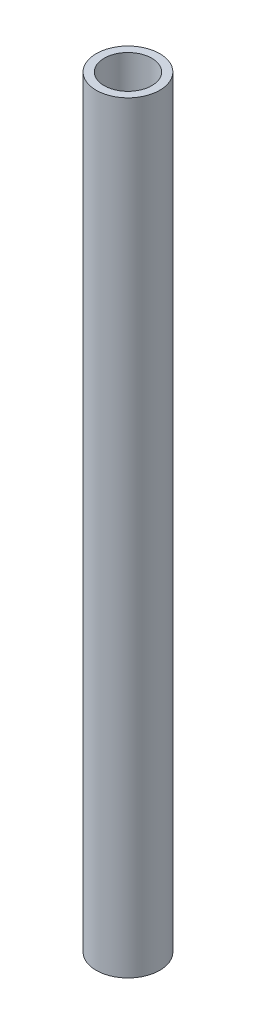
ISO-10303-21;
HEADER;
FILE_DESCRIPTION(('STEP AP214'),'2;1');
FILE_NAME('part.step','',(''),(''),'','','');
FILE_SCHEMA(('AUTOMOTIVE_DESIGN { 1 0 10303 214 1 1 1 1 }'));
ENDSEC;
DATA;
#1=APPLICATION_CONTEXT('core data for automotive mechanical design processes');
#2=APPLICATION_PROTOCOL_DEFINITION('international standard','automotive_design',2000,#1);
#3=PRODUCT_CONTEXT('',#1,'mechanical');
#4=PRODUCT('Part','Part','',(#3));
#5=PRODUCT_RELATED_PRODUCT_CATEGORY('part','',(#4));
#6=PRODUCT_DEFINITION_FORMATION('','',#4);
#7=PRODUCT_DEFINITION_CONTEXT('part definition',#1,'design');
#8=PRODUCT_DEFINITION('design','',#6,#7);
#9=PRODUCT_DEFINITION_SHAPE('','',#8);
#10=(LENGTH_UNIT() NAMED_UNIT(*) SI_UNIT(.MILLI.,.METRE.));
#11=(NAMED_UNIT(*) PLANE_ANGLE_UNIT() SI_UNIT($,.RADIAN.));
#12=(NAMED_UNIT(*) SI_UNIT($,.STERADIAN.) SOLID_ANGLE_UNIT());
#13=UNCERTAINTY_MEASURE_WITH_UNIT(LENGTH_MEASURE(1.E-05),#10,'distance_accuracy_value','');
#14=(GEOMETRIC_REPRESENTATION_CONTEXT(3) GLOBAL_UNCERTAINTY_ASSIGNED_CONTEXT((#13)) GLOBAL_UNIT_ASSIGNED_CONTEXT((#10,
#11,#12)) REPRESENTATION_CONTEXT('',''));
#15=CARTESIAN_POINT('',(0.,0.,0.));
#16=DIRECTION('',(0.,0.,1.));
#17=DIRECTION('',(1.,0.,0.));
#18=AXIS2_PLACEMENT_3D('',#15,#16,#17);
#19=CARTESIAN_POINT('',(0.,120.,0.));
#20=DIRECTION('',(0.,1.,0.));
#21=DIRECTION('',(0.,0.,1.));
#22=AXIS2_PLACEMENT_3D('',#19,#20,#21);
#23=PLANE('',#22);
#24=CARTESIAN_POINT('',(0.,120.,0.));
#25=DIRECTION('',(0.,1.,0.));
#26=DIRECTION('',(0.,0.,1.));
#27=AXIS2_PLACEMENT_3D('',#24,#25,#26);
#28=CIRCLE('',#27,5.);
#29=CARTESIAN_POINT('',(0.,120.,5.));
#30=VERTEX_POINT('',#29);
#31=EDGE_CURVE('E10',#30,#30,#28,.T.);
#32=ORIENTED_EDGE('',*,*,#31,.T.);
#33=EDGE_LOOP('',(#32));
#34=FACE_BOUND('',#33,.T.);
#35=CARTESIAN_POINT('',(0.,120.,0.));
#36=DIRECTION('',(0.,1.,0.));
#37=DIRECTION('',(0.,0.,1.));
#38=AXIS2_PLACEMENT_3D('',#35,#36,#37);
#39=CIRCLE('',#38,3.75);
#40=CARTESIAN_POINT('',(0.,120.,3.75));
#41=VERTEX_POINT('',#40);
#42=EDGE_CURVE('E50',#41,#41,#39,.T.);
#43=ORIENTED_EDGE('',*,*,#42,.F.);
#44=EDGE_LOOP('',(#43));
#45=FACE_BOUND('',#44,.T.);
#46=ADVANCED_FACE('F37',(#34,#45),#23,.T.);
#47=CARTESIAN_POINT('',(0.,0.,0.));
#48=DIRECTION('',(0.,1.,0.));
#49=DIRECTION('',(0.,0.,1.));
#50=AXIS2_PLACEMENT_3D('',#47,#48,#49);
#51=PLANE('',#50);
#52=CARTESIAN_POINT('',(0.,0.,0.));
#53=DIRECTION('',(0.,1.,0.));
#54=DIRECTION('',(0.,0.,1.));
#55=AXIS2_PLACEMENT_3D('',#52,#53,#54);
#56=CIRCLE('',#55,5.);
#57=CARTESIAN_POINT('',(0.,0.,5.));
#58=VERTEX_POINT('',#57);
#59=EDGE_CURVE('E41',#58,#58,#56,.T.);
#60=ORIENTED_EDGE('',*,*,#59,.F.);
#61=EDGE_LOOP('',(#60));
#62=FACE_BOUND('',#61,.T.);
#63=CARTESIAN_POINT('',(0.,0.,0.));
#64=DIRECTION('',(0.,1.,0.));
#65=DIRECTION('',(0.,0.,1.));
#66=AXIS2_PLACEMENT_3D('',#63,#64,#65);
#67=CIRCLE('',#66,3.75);
#68=CARTESIAN_POINT('',(0.,0.,3.75));
#69=VERTEX_POINT('',#68);
#70=EDGE_CURVE('E52',#69,#69,#67,.T.);
#71=ORIENTED_EDGE('',*,*,#70,.T.);
#72=EDGE_LOOP('',(#71));
#73=FACE_BOUND('',#72,.T.);
#74=ADVANCED_FACE('F64',(#62,#73),#51,.F.);
#75=CARTESIAN_POINT('',(0.,120.,0.));
#76=DIRECTION('',(0.,-1.,0.));
#77=DIRECTION('',(0.,0.,-1.));
#78=AXIS2_PLACEMENT_3D('',#75,#76,#77);
#79=CYLINDRICAL_SURFACE('',#78,5.);
#80=ORIENTED_EDGE('',*,*,#31,.F.);
#81=EDGE_LOOP('',(#80));
#82=FACE_BOUND('',#81,.T.);
#83=ORIENTED_EDGE('',*,*,#59,.T.);
#84=EDGE_LOOP('',(#83));
#85=FACE_BOUND('',#84,.T.);
#86=ADVANCED_FACE('F39',(#82,#85),#79,.T.);
#87=CARTESIAN_POINT('',(0.,120.,0.));
#88=DIRECTION('',(0.,-1.,0.));
#89=DIRECTION('',(0.,0.,-1.));
#90=AXIS2_PLACEMENT_3D('',#87,#88,#89);
#91=CYLINDRICAL_SURFACE('',#90,3.75);
#92=ORIENTED_EDGE('',*,*,#42,.T.);
#93=EDGE_LOOP('',(#92));
#94=FACE_BOUND('',#93,.T.);
#95=ORIENTED_EDGE('',*,*,#70,.F.);
#96=EDGE_LOOP('',(#95));
#97=FACE_BOUND('',#96,.T.);
#98=ADVANCED_FACE('F60',(#94,#97),#91,.F.);
#99=CLOSED_SHELL('',(#46,#74,#86,#98));
#100=MANIFOLD_SOLID_BREP('B2',#99);
#101=ADVANCED_BREP_SHAPE_REPRESENTATION('',(#18,#100),#14);
#102=SHAPE_DEFINITION_REPRESENTATION(#9,#101);
ENDSEC;
END-ISO-10303-21;
